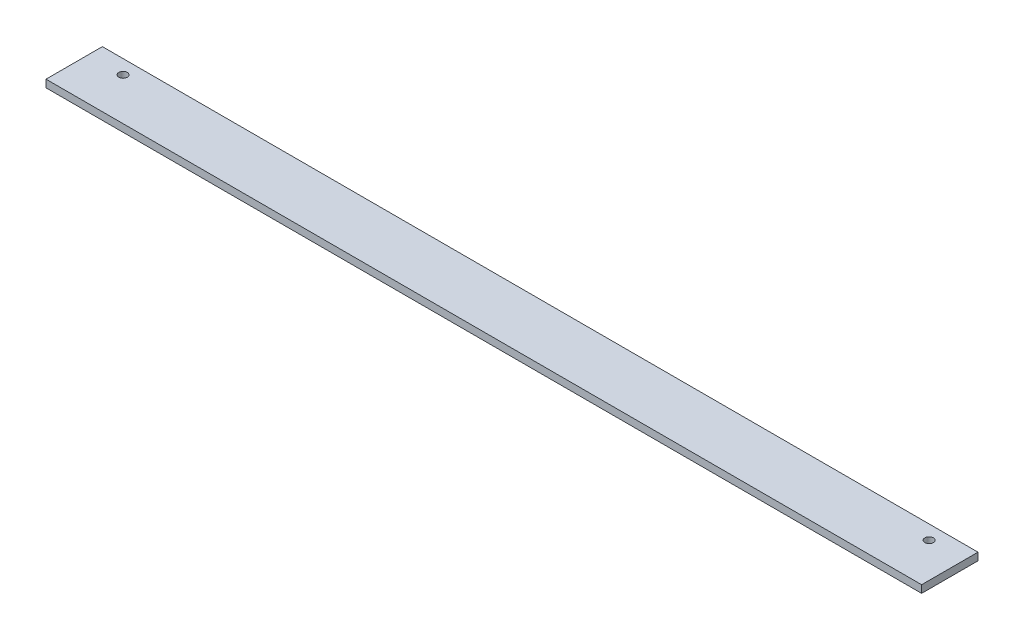
ISO-10303-21;
HEADER;
FILE_DESCRIPTION(('STEP AP214'),'2;1');
FILE_NAME('part.step','',(''),(''),'','','');
FILE_SCHEMA(('AUTOMOTIVE_DESIGN { 1 0 10303 214 1 1 1 1 }'));
ENDSEC;
DATA;
#1=APPLICATION_CONTEXT('core data for automotive mechanical design processes');
#2=APPLICATION_PROTOCOL_DEFINITION('international standard','automotive_design',2000,#1);
#3=PRODUCT_CONTEXT('',#1,'mechanical');
#4=PRODUCT('Part','Part','',(#3));
#5=PRODUCT_RELATED_PRODUCT_CATEGORY('part','',(#4));
#6=PRODUCT_DEFINITION_FORMATION('','',#4);
#7=PRODUCT_DEFINITION_CONTEXT('part definition',#1,'design');
#8=PRODUCT_DEFINITION('design','',#6,#7);
#9=PRODUCT_DEFINITION_SHAPE('','',#8);
#10=(LENGTH_UNIT() NAMED_UNIT(*) SI_UNIT(.MILLI.,.METRE.));
#11=(NAMED_UNIT(*) PLANE_ANGLE_UNIT() SI_UNIT($,.RADIAN.));
#12=(NAMED_UNIT(*) SI_UNIT($,.STERADIAN.) SOLID_ANGLE_UNIT());
#13=UNCERTAINTY_MEASURE_WITH_UNIT(LENGTH_MEASURE(1.E-05),#10,'distance_accuracy_value','');
#14=(GEOMETRIC_REPRESENTATION_CONTEXT(3) GLOBAL_UNCERTAINTY_ASSIGNED_CONTEXT((#13)) GLOBAL_UNIT_ASSIGNED_CONTEXT((#10,
#11,#12)) REPRESENTATION_CONTEXT('',''));
#15=CARTESIAN_POINT('',(0.,0.,0.));
#16=DIRECTION('',(0.,0.,1.));
#17=DIRECTION('',(1.,0.,0.));
#18=AXIS2_PLACEMENT_3D('',#15,#16,#17);
#19=CARTESIAN_POINT('',(466.,-2.,-15.));
#20=DIRECTION('',(0.,0.,1.));
#21=DIRECTION('',(1.,0.,0.));
#22=AXIS2_PLACEMENT_3D('',#19,#20,#21);
#23=PLANE('',#22);
#24=DIRECTION('',(0.,1.,0.));
#25=VECTOR('',#24,1.);
#26=CARTESIAN_POINT('',(0.,-2.,-15.));
#27=LINE('',#26,#25);
#28=CARTESIAN_POINT('',(0.,-2.,-15.));
#29=VERTEX_POINT('',#28);
#30=CARTESIAN_POINT('',(0.,2.,-15.));
#31=VERTEX_POINT('',#30);
#32=EDGE_CURVE('E99',#29,#31,#27,.T.);
#33=ORIENTED_EDGE('',*,*,#32,.T.);
#34=DIRECTION('',(-1.,0.,0.));
#35=VECTOR('',#34,1.);
#36=CARTESIAN_POINT('',(466.,2.,-15.));
#37=LINE('',#36,#35);
#38=CARTESIAN_POINT('',(466.,2.,-15.));
#39=VERTEX_POINT('',#38);
#40=EDGE_CURVE('E11',#39,#31,#37,.T.);
#41=ORIENTED_EDGE('',*,*,#40,.F.);
#42=DIRECTION('',(0.,1.,0.));
#43=VECTOR('',#42,1.);
#44=CARTESIAN_POINT('',(466.,-2.,-15.));
#45=LINE('',#44,#43);
#46=CARTESIAN_POINT('',(466.,-2.,-15.));
#47=VERTEX_POINT('',#46);
#48=EDGE_CURVE('E87',#47,#39,#45,.T.);
#49=ORIENTED_EDGE('',*,*,#48,.F.);
#50=DIRECTION('',(-1.,0.,0.));
#51=VECTOR('',#50,1.);
#52=CARTESIAN_POINT('',(466.,-2.,-15.));
#53=LINE('',#52,#51);
#54=EDGE_CURVE('E95',#47,#29,#53,.T.);
#55=ORIENTED_EDGE('',*,*,#54,.T.);
#56=EDGE_LOOP('',(#33,#41,#49,#55));
#57=FACE_BOUND('',#56,.T.);
#58=ADVANCED_FACE('F36',(#57),#23,.F.);
#59=CARTESIAN_POINT('',(466.,2.,15.));
#60=DIRECTION('',(0.,-1.,0.));
#61=DIRECTION('',(0.,0.,-1.));
#62=AXIS2_PLACEMENT_3D('',#59,#60,#61);
#63=PLANE('',#62);
#64=CARTESIAN_POINT('',(18.5,2.,-7.5));
#65=DIRECTION('',(0.,1.,0.));
#66=DIRECTION('',(0.,0.,1.));
#67=AXIS2_PLACEMENT_3D('',#64,#65,#66);
#68=CIRCLE('',#67,2.25);
#69=CARTESIAN_POINT('',(18.5,2.,-5.25));
#70=VERTEX_POINT('',#69);
#71=EDGE_CURVE('E119',#70,#70,#68,.T.);
#72=ORIENTED_EDGE('',*,*,#71,.F.);
#73=EDGE_LOOP('',(#72));
#74=FACE_BOUND('',#73,.T.);
#75=CARTESIAN_POINT('',(447.5,2.,-7.5));
#76=DIRECTION('',(0.,1.,0.));
#77=DIRECTION('',(0.,0.,1.));
#78=AXIS2_PLACEMENT_3D('',#75,#76,#77);
#79=CIRCLE('',#78,2.24999999999995);
#80=CARTESIAN_POINT('',(447.5,2.,-5.25000000000005));
#81=VERTEX_POINT('',#80);
#82=EDGE_CURVE('E113',#81,#81,#79,.T.);
#83=ORIENTED_EDGE('',*,*,#82,.F.);
#84=EDGE_LOOP('',(#83));
#85=FACE_BOUND('',#84,.T.);
#86=DIRECTION('',(0.,0.,1.));
#87=VECTOR('',#86,1.);
#88=CARTESIAN_POINT('',(0.,2.,15.));
#89=LINE('',#88,#87);
#90=CARTESIAN_POINT('',(0.,2.,15.));
#91=VERTEX_POINT('',#90);
#92=EDGE_CURVE('E91',#31,#91,#89,.T.);
#93=ORIENTED_EDGE('',*,*,#92,.T.);
#94=DIRECTION('',(-1.,0.,0.));
#95=VECTOR('',#94,1.);
#96=CARTESIAN_POINT('',(466.,2.,15.));
#97=LINE('',#96,#95);
#98=CARTESIAN_POINT('',(466.,2.,15.));
#99=VERTEX_POINT('',#98);
#100=EDGE_CURVE('E44',#99,#91,#97,.T.);
#101=ORIENTED_EDGE('',*,*,#100,.F.);
#102=DIRECTION('',(0.,0.,1.));
#103=VECTOR('',#102,1.);
#104=CARTESIAN_POINT('',(466.,2.,15.));
#105=LINE('',#104,#103);
#106=EDGE_CURVE('E82',#39,#99,#105,.T.);
#107=ORIENTED_EDGE('',*,*,#106,.F.);
#108=ORIENTED_EDGE('',*,*,#40,.T.);
#109=EDGE_LOOP('',(#93,#101,#107,#108));
#110=FACE_BOUND('',#109,.T.);
#111=ADVANCED_FACE('F90',(#74,#85,#110),#63,.F.);
#112=CARTESIAN_POINT('',(466.,-2.,15.));
#113=DIRECTION('',(0.,0.,-1.));
#114=DIRECTION('',(-1.,0.,0.));
#115=AXIS2_PLACEMENT_3D('',#112,#113,#114);
#116=PLANE('',#115);
#117=DIRECTION('',(0.,-1.,0.));
#118=VECTOR('',#117,1.);
#119=CARTESIAN_POINT('',(0.,-2.,15.));
#120=LINE('',#119,#118);
#121=CARTESIAN_POINT('',(0.,-2.,15.));
#122=VERTEX_POINT('',#121);
#123=EDGE_CURVE('E69',#91,#122,#120,.T.);
#124=ORIENTED_EDGE('',*,*,#123,.T.);
#125=DIRECTION('',(-1.,0.,0.));
#126=VECTOR('',#125,1.);
#127=CARTESIAN_POINT('',(466.,-2.,15.));
#128=LINE('',#127,#126);
#129=CARTESIAN_POINT('',(466.,-2.,15.));
#130=VERTEX_POINT('',#129);
#131=EDGE_CURVE('E92',#130,#122,#128,.T.);
#132=ORIENTED_EDGE('',*,*,#131,.F.);
#133=DIRECTION('',(0.,-1.,0.));
#134=VECTOR('',#133,1.);
#135=CARTESIAN_POINT('',(466.,-2.,15.));
#136=LINE('',#135,#134);
#137=EDGE_CURVE('E85',#99,#130,#136,.T.);
#138=ORIENTED_EDGE('',*,*,#137,.F.);
#139=ORIENTED_EDGE('',*,*,#100,.T.);
#140=EDGE_LOOP('',(#124,#132,#138,#139));
#141=FACE_BOUND('',#140,.T.);
#142=ADVANCED_FACE('F93',(#141),#116,.F.);
#143=CARTESIAN_POINT('',(466.,-2.,15.));
#144=DIRECTION('',(0.,1.,0.));
#145=DIRECTION('',(0.,0.,1.));
#146=AXIS2_PLACEMENT_3D('',#143,#144,#145);
#147=PLANE('',#146);
#148=CARTESIAN_POINT('',(18.5,-2.,-7.5));
#149=DIRECTION('',(0.,1.,0.));
#150=DIRECTION('',(0.,0.,1.));
#151=AXIS2_PLACEMENT_3D('',#148,#149,#150);
#152=CIRCLE('',#151,2.25);
#153=CARTESIAN_POINT('',(18.5,-2.,-5.25));
#154=VERTEX_POINT('',#153);
#155=EDGE_CURVE('E102',#154,#154,#152,.T.);
#156=ORIENTED_EDGE('',*,*,#155,.T.);
#157=EDGE_LOOP('',(#156));
#158=FACE_BOUND('',#157,.T.);
#159=CARTESIAN_POINT('',(447.5,-2.,-7.5));
#160=DIRECTION('',(0.,1.,0.));
#161=DIRECTION('',(0.,0.,1.));
#162=AXIS2_PLACEMENT_3D('',#159,#160,#161);
#163=CIRCLE('',#162,2.24999999999995);
#164=CARTESIAN_POINT('',(447.5,-2.,-5.25000000000005));
#165=VERTEX_POINT('',#164);
#166=EDGE_CURVE('E116',#165,#165,#163,.T.);
#167=ORIENTED_EDGE('',*,*,#166,.T.);
#168=EDGE_LOOP('',(#167));
#169=FACE_BOUND('',#168,.T.);
#170=DIRECTION('',(0.,0.,-1.));
#171=VECTOR('',#170,1.);
#172=CARTESIAN_POINT('',(0.,-2.,15.));
#173=LINE('',#172,#171);
#174=EDGE_CURVE('E75',#122,#29,#173,.T.);
#175=ORIENTED_EDGE('',*,*,#174,.T.);
#176=ORIENTED_EDGE('',*,*,#54,.F.);
#177=DIRECTION('',(0.,0.,-1.));
#178=VECTOR('',#177,1.);
#179=CARTESIAN_POINT('',(466.,-2.,15.));
#180=LINE('',#179,#178);
#181=EDGE_CURVE('E52',#130,#47,#180,.T.);
#182=ORIENTED_EDGE('',*,*,#181,.F.);
#183=ORIENTED_EDGE('',*,*,#131,.T.);
#184=EDGE_LOOP('',(#175,#176,#182,#183));
#185=FACE_BOUND('',#184,.T.);
#186=ADVANCED_FACE('F107',(#158,#169,#185),#147,.F.);
#187=CARTESIAN_POINT('',(466.,0.,0.));
#188=DIRECTION('',(-1.,0.,0.));
#189=DIRECTION('',(0.,0.,1.));
#190=AXIS2_PLACEMENT_3D('',#187,#188,#189);
#191=PLANE('',#190);
#192=ORIENTED_EDGE('',*,*,#48,.T.);
#193=ORIENTED_EDGE('',*,*,#106,.T.);
#194=ORIENTED_EDGE('',*,*,#137,.T.);
#195=ORIENTED_EDGE('',*,*,#181,.T.);
#196=EDGE_LOOP('',(#192,#193,#194,#195));
#197=FACE_BOUND('',#196,.T.);
#198=ADVANCED_FACE('F83',(#197),#191,.F.);
#199=CARTESIAN_POINT('',(0.,0.,0.));
#200=DIRECTION('',(-1.,0.,0.));
#201=DIRECTION('',(0.,0.,1.));
#202=AXIS2_PLACEMENT_3D('',#199,#200,#201);
#203=PLANE('',#202);
#204=ORIENTED_EDGE('',*,*,#32,.F.);
#205=ORIENTED_EDGE('',*,*,#174,.F.);
#206=ORIENTED_EDGE('',*,*,#123,.F.);
#207=ORIENTED_EDGE('',*,*,#92,.F.);
#208=EDGE_LOOP('',(#204,#205,#206,#207));
#209=FACE_BOUND('',#208,.T.);
#210=ADVANCED_FACE('F110',(#209),#203,.T.);
#211=CARTESIAN_POINT('',(447.5,-2.,-7.5));
#212=DIRECTION('',(0.,1.,0.));
#213=DIRECTION('',(0.,0.,1.));
#214=AXIS2_PLACEMENT_3D('',#211,#212,#213);
#215=CYLINDRICAL_SURFACE('',#214,2.24999999999995);
#216=ORIENTED_EDGE('',*,*,#166,.F.);
#217=EDGE_LOOP('',(#216));
#218=FACE_BOUND('',#217,.T.);
#219=ORIENTED_EDGE('',*,*,#82,.T.);
#220=EDGE_LOOP('',(#219));
#221=FACE_BOUND('',#220,.T.);
#222=ADVANCED_FACE('F130',(#218,#221),#215,.F.);
#223=CARTESIAN_POINT('',(18.5,-2.,-7.5));
#224=DIRECTION('',(0.,1.,0.));
#225=DIRECTION('',(0.,0.,1.));
#226=AXIS2_PLACEMENT_3D('',#223,#224,#225);
#227=CYLINDRICAL_SURFACE('',#226,2.25);
#228=ORIENTED_EDGE('',*,*,#155,.F.);
#229=EDGE_LOOP('',(#228));
#230=FACE_BOUND('',#229,.T.);
#231=ORIENTED_EDGE('',*,*,#71,.T.);
#232=EDGE_LOOP('',(#231));
#233=FACE_BOUND('',#232,.T.);
#234=ADVANCED_FACE('F127',(#230,#233),#227,.F.);
#235=CLOSED_SHELL('',(#58,#111,#142,#186,#198,#210,#222,#234));
#236=MANIFOLD_SOLID_BREP('B2',#235);
#237=ADVANCED_BREP_SHAPE_REPRESENTATION('',(#18,#236),#14);
#238=SHAPE_DEFINITION_REPRESENTATION(#9,#237);
ENDSEC;
END-ISO-10303-21;
